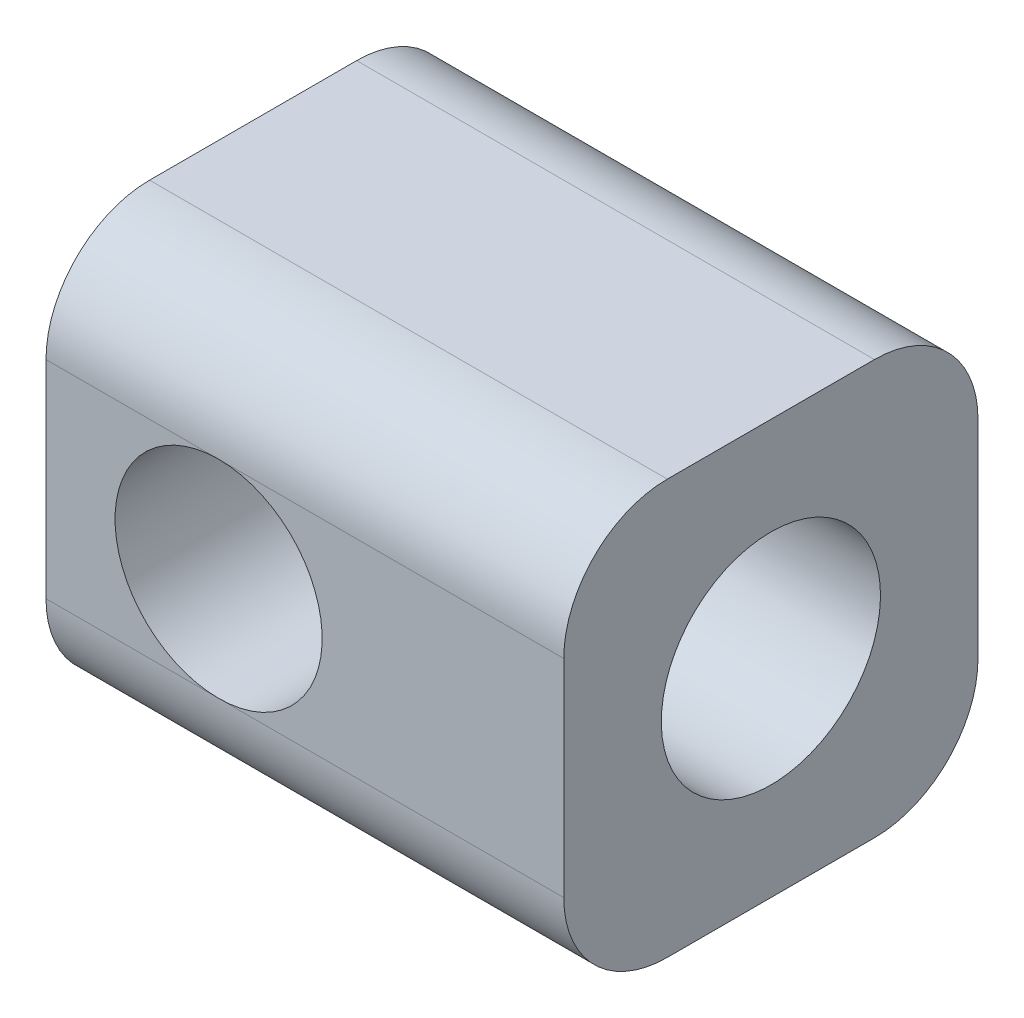
ISO-10303-21;
HEADER;
FILE_DESCRIPTION(('STEP AP214'),'2;1');
FILE_NAME('part.step','',(''),(''),'','','');
FILE_SCHEMA(('AUTOMOTIVE_DESIGN { 1 0 10303 214 1 1 1 1 }'));
ENDSEC;
DATA;
#1=APPLICATION_CONTEXT('core data for automotive mechanical design processes');
#2=APPLICATION_PROTOCOL_DEFINITION('international standard','automotive_design',2000,#1);
#3=PRODUCT_CONTEXT('',#1,'mechanical');
#4=PRODUCT('Part','Part','',(#3));
#5=PRODUCT_RELATED_PRODUCT_CATEGORY('part','',(#4));
#6=PRODUCT_DEFINITION_FORMATION('','',#4);
#7=PRODUCT_DEFINITION_CONTEXT('part definition',#1,'design');
#8=PRODUCT_DEFINITION('design','',#6,#7);
#9=PRODUCT_DEFINITION_SHAPE('','',#8);
#10=(LENGTH_UNIT() NAMED_UNIT(*) SI_UNIT(.MILLI.,.METRE.));
#11=(NAMED_UNIT(*) PLANE_ANGLE_UNIT() SI_UNIT($,.RADIAN.));
#12=(NAMED_UNIT(*) SI_UNIT($,.STERADIAN.) SOLID_ANGLE_UNIT());
#13=UNCERTAINTY_MEASURE_WITH_UNIT(LENGTH_MEASURE(1.E-05),#10,'distance_accuracy_value','');
#14=(GEOMETRIC_REPRESENTATION_CONTEXT(3) GLOBAL_UNCERTAINTY_ASSIGNED_CONTEXT((#13)) GLOBAL_UNIT_ASSIGNED_CONTEXT((#10,
#11,#12)) REPRESENTATION_CONTEXT('',''));
#15=CARTESIAN_POINT('',(0.,0.,0.));
#16=DIRECTION('',(0.,0.,1.));
#17=DIRECTION('',(1.,0.,0.));
#18=AXIS2_PLACEMENT_3D('',#15,#16,#17);
#19=CARTESIAN_POINT('',(0.,0.,12.));
#20=DIRECTION('',(0.,0.,-1.));
#21=DIRECTION('',(-1.,0.,0.));
#22=AXIS2_PLACEMENT_3D('',#19,#20,#21);
#23=PLANE('',#22);
#24=DIRECTION('',(0.,-1.,0.));
#25=VECTOR('',#24,1.);
#26=CARTESIAN_POINT('',(-5.,6.,12.));
#27=LINE('',#26,#25);
#28=CARTESIAN_POINT('',(-5.,3.,12.));
#29=VERTEX_POINT('',#28);
#30=CARTESIAN_POINT('',(-5.,-3.,12.));
#31=VERTEX_POINT('',#30);
#32=EDGE_CURVE('E216',#29,#31,#27,.T.);
#33=ORIENTED_EDGE('',*,*,#32,.T.);
#34=DIRECTION('',(1.,0.,0.));
#35=VECTOR('',#34,1.);
#36=CARTESIAN_POINT('',(0.,-3.,12.));
#37=LINE('',#36,#35);
#38=CARTESIAN_POINT('',(0.,-3.,12.));
#39=VERTEX_POINT('',#38);
#40=EDGE_CURVE('E275',#31,#39,#37,.T.);
#41=ORIENTED_EDGE('',*,*,#40,.T.);
#42=CARTESIAN_POINT('',(0.,0.,12.));
#43=DIRECTION('',(0.,0.,1.));
#44=DIRECTION('',(1.,0.,0.));
#45=AXIS2_PLACEMENT_3D('',#42,#43,#44);
#46=CIRCLE('',#45,3.);
#47=CARTESIAN_POINT('',(0.,3.,12.));
#48=VERTEX_POINT('',#47);
#49=EDGE_CURVE('E203',#48,#39,#46,.T.);
#50=ORIENTED_EDGE('',*,*,#49,.F.);
#51=DIRECTION('',(-1.,0.,0.));
#52=VECTOR('',#51,1.);
#53=CARTESIAN_POINT('',(0.,3.,12.));
#54=LINE('',#53,#52);
#55=EDGE_CURVE('E56',#48,#29,#54,.T.);
#56=ORIENTED_EDGE('',*,*,#55,.T.);
#57=EDGE_LOOP('',(#33,#41,#50,#56));
#58=FACE_BOUND('',#57,.T.);
#59=ADVANCED_FACE('F33',(#58),#23,.F.);
#60=CARTESIAN_POINT('',(0.,0.,0.));
#61=DIRECTION('',(0.,0.,-1.));
#62=DIRECTION('',(-1.,0.,0.));
#63=AXIS2_PLACEMENT_3D('',#60,#61,#62);
#64=PLANE('',#63);
#65=DIRECTION('',(0.,1.,0.));
#66=VECTOR('',#65,1.);
#67=CARTESIAN_POINT('',(10.,6.,0.));
#68=LINE('',#67,#66);
#69=CARTESIAN_POINT('',(10.,-3.,0.));
#70=VERTEX_POINT('',#69);
#71=CARTESIAN_POINT('',(10.,3.,0.));
#72=VERTEX_POINT('',#71);
#73=EDGE_CURVE('E209',#70,#72,#68,.T.);
#74=ORIENTED_EDGE('',*,*,#73,.F.);
#75=DIRECTION('',(1.,0.,0.));
#76=VECTOR('',#75,1.);
#77=CARTESIAN_POINT('',(-5.,-3.,0.));
#78=LINE('',#77,#76);
#79=CARTESIAN_POINT('',(0.,-3.,0.));
#80=VERTEX_POINT('',#79);
#81=EDGE_CURVE('E263',#70,#80,#78,.F.);
#82=ORIENTED_EDGE('',*,*,#81,.T.);
#83=CARTESIAN_POINT('',(0.,0.,0.));
#84=DIRECTION('',(0.,0.,1.));
#85=DIRECTION('',(1.,0.,0.));
#86=AXIS2_PLACEMENT_3D('',#83,#84,#85);
#87=CIRCLE('',#86,3.);
#88=CARTESIAN_POINT('',(0.,3.,0.));
#89=VERTEX_POINT('',#88);
#90=EDGE_CURVE('E140',#80,#89,#87,.T.);
#91=ORIENTED_EDGE('',*,*,#90,.T.);
#92=DIRECTION('',(-1.,0.,0.));
#93=VECTOR('',#92,1.);
#94=CARTESIAN_POINT('',(10.,3.,0.));
#95=LINE('',#94,#93);
#96=EDGE_CURVE('E257',#89,#72,#95,.F.);
#97=ORIENTED_EDGE('',*,*,#96,.T.);
#98=EDGE_LOOP('',(#74,#82,#91,#97));
#99=FACE_BOUND('',#98,.T.);
#100=ADVANCED_FACE('F176',(#99),#64,.T.);
#101=CARTESIAN_POINT('',(0.,0.,12.));
#102=DIRECTION('',(0.,0.,-1.));
#103=DIRECTION('',(-1.,0.,0.));
#104=AXIS2_PLACEMENT_3D('',#101,#102,#103);
#105=CYLINDRICAL_SURFACE('',#104,3.);
#106=ORIENTED_EDGE('',*,*,#49,.T.);
#107=EDGE_CURVE('E197',#39,#48,#46,.T.);
#108=ORIENTED_EDGE('',*,*,#107,.T.);
#109=EDGE_LOOP('',(#106,#108));
#110=FACE_BOUND('',#109,.T.);
#111=EDGE_CURVE('E204',#89,#80,#87,.T.);
#112=ORIENTED_EDGE('',*,*,#111,.F.);
#113=ORIENTED_EDGE('',*,*,#90,.F.);
#114=EDGE_LOOP('',(#112,#113));
#115=FACE_BOUND('',#114,.T.);
#116=CARTESIAN_POINT('',(0.,-3.,7.03953114431459));
#117=CARTESIAN_POINT('',(0.0386237414145725,-3.00000902596069,7.03947907339333));
#118=CARTESIAN_POINT('',(0.077191741271471,-2.99925418392717,7.0416840085267));
#119=CARTESIAN_POINT('',(0.153670356620564,-2.99630274009657,7.05015658215252));
#120=CARTESIAN_POINT('',(0.191583015848006,-2.99411204858188,7.05640756488609));
#121=CARTESIAN_POINT('',(0.302325512784669,-2.98563259746018,7.08022760956141));
#122=CARTESIAN_POINT('',(0.373911746826772,-2.9774281765451,7.10290418160596));
#123=CARTESIAN_POINT('',(0.498360581096125,-2.95884481821173,7.15169126914045));
#124=CARTESIAN_POINT('',(0.552050957062252,-2.94925757080144,7.17614226083754));
#125=CARTESIAN_POINT('',(0.657008734379159,-2.92766123490288,7.22892018324124));
#126=CARTESIAN_POINT('',(0.70827457212563,-2.91565060915546,7.25724957050499));
#127=CARTESIAN_POINT('',(0.860275392427387,-2.87594138502498,7.34678953024243));
#128=CARTESIAN_POINT('',(0.957780414907473,-2.84479327639407,7.41190592962394));
#129=CARTESIAN_POINT('',(1.14840861498714,-2.77338884677889,7.54757616252779));
#130=CARTESIAN_POINT('',(1.24140616390303,-2.73296378165888,7.61821235116885));
#131=CARTESIAN_POINT('',(1.42221803307757,-2.64338313136646,7.7607510815286));
#132=CARTESIAN_POINT('',(1.51002810982015,-2.59422052685146,7.83265459921106));
#133=CARTESIAN_POINT('',(1.68035120282555,-2.48726351914778,7.97536587954332));
#134=CARTESIAN_POINT('',(1.76288633872597,-2.42950907749845,8.04617712310709));
#135=CARTESIAN_POINT('',(1.92283380471833,-2.30498847076256,8.18549311032196));
#136=CARTESIAN_POINT('',(2.00024923633515,-2.23822783756438,8.25399923782706));
#137=CARTESIAN_POINT('',(2.18336641272797,-2.06288498919169,8.41771375606503));
#138=CARTESIAN_POINT('',(2.28595510917601,-1.94907552829243,8.51092605380873));
#139=CARTESIAN_POINT('',(2.47597716349436,-1.70113011021957,8.68508192561453));
#140=CARTESIAN_POINT('',(2.56342764033279,-1.56701743895335,8.76603934485019));
#141=CARTESIAN_POINT('',(2.70229077967412,-1.30932973919755,8.89525490761508));
#142=CARTESIAN_POINT('',(2.75741528278771,-1.18942221010328,8.94681060060623));
#143=CARTESIAN_POINT('',(2.85249227315262,-0.93870779714176,9.03596156538605));
#144=CARTESIAN_POINT('',(2.89245502874539,-0.807908363325609,9.07356628513166));
#145=CARTESIAN_POINT('',(2.9390981328215,-0.605461356604541,9.11751458141742));
#146=CARTESIAN_POINT('',(2.9524581070525,-0.536619520762502,9.13011520004243));
#147=CARTESIAN_POINT('',(2.97437781216004,-0.397519653742324,9.15079906570895));
#148=CARTESIAN_POINT('',(2.98293987330491,-0.327262327251928,9.15888450569265));
#149=CARTESIAN_POINT('',(2.99507086233577,-0.185950737316526,9.17034233146573));
#150=CARTESIAN_POINT('',(2.99864102354096,-0.114896675090901,9.17371588139371));
#151=CARTESIAN_POINT('',(3.00071992156506,0.0273281394377825,9.17568029065169));
#152=CARTESIAN_POINT('',(2.99922918770584,0.0984988787593104,9.17427165015369));
#153=CARTESIAN_POINT('',(2.98816022983791,0.293930701974193,9.16381392438657));
#154=CARTESIAN_POINT('',(2.9733247453996,0.417696940171533,9.14979835587381));
#155=CARTESIAN_POINT('',(2.92907854121659,0.660094995851278,9.10806586117788));
#156=CARTESIAN_POINT('',(2.89966548966234,0.778725988604086,9.08034674299368));
#157=CARTESIAN_POINT('',(2.82705648635023,1.01143192503278,9.01209484117222));
#158=CARTESIAN_POINT('',(2.78351897112101,1.12530550201754,8.97124477139125));
#159=CARTESIAN_POINT('',(2.68504873203715,1.34345274972221,8.87920245240652));
#160=CARTESIAN_POINT('',(2.63011185130384,1.44772289838461,8.82800643063878));
#161=CARTESIAN_POINT('',(2.4799558295988,1.69723851572361,8.68879977035802));
#162=CARTESIAN_POINT('',(2.3785916736286,1.8358105479557,8.59543707337147));
#163=CARTESIAN_POINT('',(2.15942529990749,2.08928852819717,8.39616565001319));
#164=CARTESIAN_POINT('',(2.04157222492708,2.20411842395232,8.29021826713069));
#165=CARTESIAN_POINT('',(1.83846923363854,2.37286810045156,8.11168231401367));
#166=CARTESIAN_POINT('',(1.75707591257527,2.43369787012433,8.04107853816913));
#167=CARTESIAN_POINT('',(1.58927348273243,2.54645732332912,7.89853492520537));
#168=CARTESIAN_POINT('',(1.50286037720401,2.59837978116328,7.82659405536106));
#169=CARTESIAN_POINT('',(1.32494777339686,2.69345364991622,7.68324909468567));
#170=CARTESIAN_POINT('',(1.23344870165354,2.73660579494964,7.6118449594097));
#171=CARTESIAN_POINT('',(1.04455892460352,2.81413120001225,7.47227873616029));
#172=CARTESIAN_POINT('',(0.947177041593537,2.84851722101503,7.40411205445834));
#173=CARTESIAN_POINT('',(0.775323429950739,2.89900814824822,7.29568443169882));
#174=CARTESIAN_POINT('',(0.702938065203922,2.917488921965,7.25325907625086));
#175=CARTESIAN_POINT('',(0.55377856022368,2.94942369765177,7.17611054301172));
#176=CARTESIAN_POINT('',(0.477049642143094,2.96292132808154,7.14132165287264));
#177=CARTESIAN_POINT('',(0.33467823517974,2.98194188885186,7.09052313661807));
#178=CARTESIAN_POINT('',(0.270094610384132,2.98854461672715,7.07210341179885));
#179=CARTESIAN_POINT('',(0.170725118252341,2.99532719168375,7.05294251041164));
#180=CARTESIAN_POINT('',(0.136858598708708,2.99706891472262,7.04796157680255));
#181=CARTESIAN_POINT('',(0.0686729674424466,2.99940978786202,7.04123518857114));
#182=CARTESIAN_POINT('',(0.0343528398070632,3.00000566256942,7.03949900943543));
#183=CARTESIAN_POINT('',(-1.51464542244097E-13,3.00000000000003,7.03953114431503));
#184=B_SPLINE_CURVE_WITH_KNOTS('',3,(#116,#117,#118,#119,#120,#121,#122,#123,#124,#125,#126,
#127,#128,#129,#130,#131,#132,#133,#134,#135,#136,#137,#138,#139,#140,#141,#142,#143,#144,#145,
#146,#147,#148,#149,#150,#151,#152,#153,#154,#155,#156,#157,#158,#159,#160,#161,#162,#163,#164,
#165,#166,#167,#168,#169,#170,#171,#172,#173,#174,#175,#176,#177,#178,#179,#180,#181,#182,#183),
.UNSPECIFIED.,.F.,.F.,(4,2,2,2,2,2,2,2,2,2,2,2,2,2,2,2,2,2,2,2,2,2,2,2,2,2,2,2,2,2,2,2,2,4),(0.,
0.115707852134544,0.230942390599249,0.456263444007898,0.635347993460676,0.814546503579332,
1.17766371562131,1.54799891599954,1.91863298285451,2.28759417687732,2.65632976643466,
3.19245792984402,3.72797579797249,4.15143300008061,4.57460290033464,4.78808266091405,
5.00145864778265,5.21478190778768,5.42808285687984,5.80246114248235,6.17689933250815,
6.56116743588479,6.94557591303456,7.52865116230385,8.11356616626125,8.48437803210382,
8.85548929613308,9.22656948367514,9.59710635948357,9.85447723484143,10.1095381067564,
10.3109967764483,10.4136582371093,10.5166127205756),.UNSPECIFIED.);
#185=CARTESIAN_POINT('',(0.,-3.,7.03953114431459));
#186=VERTEX_POINT('',#185);
#187=CARTESIAN_POINT('',(0.,3.,7.03953114431459));
#188=VERTEX_POINT('',#187);
#189=EDGE_CURVE('E131',#186,#188,#184,.T.);
#190=ORIENTED_EDGE('',*,*,#189,.F.);
#191=DIRECTION('',(0.,0.,-1.));
#192=VECTOR('',#191,1.);
#193=CARTESIAN_POINT('',(0.,-3.,12.));
#194=LINE('',#193,#192);
#195=CARTESIAN_POINT('',(0.,-3.,4.96046885568541));
#196=VERTEX_POINT('',#195);
#197=EDGE_CURVE('E123',#186,#196,#194,.T.);
#198=ORIENTED_EDGE('',*,*,#197,.T.);
#199=CARTESIAN_POINT('',(0.,3.,4.96046885568541));
#200=CARTESIAN_POINT('',(0.0386237414145718,3.00000902596069,4.96052092660667));
#201=CARTESIAN_POINT('',(0.0771917412714701,2.99925418392717,4.9583159914733));
#202=CARTESIAN_POINT('',(0.153670356620563,2.99630274009657,4.94984341784748));
#203=CARTESIAN_POINT('',(0.191583015848005,2.99411204858188,4.94359243511391));
#204=CARTESIAN_POINT('',(0.302325512784668,2.98563259746018,4.91977239043859));
#205=CARTESIAN_POINT('',(0.373911746826771,2.9774281765451,4.89709581839404));
#206=CARTESIAN_POINT('',(0.498360581096125,2.95884481821173,4.84830873085955));
#207=CARTESIAN_POINT('',(0.552050957062251,2.94925757080144,4.82385773916246));
#208=CARTESIAN_POINT('',(0.657008734379159,2.92766123490288,4.77107981675876));
#209=CARTESIAN_POINT('',(0.70827457212563,2.91565060915546,4.74275042949501));
#210=CARTESIAN_POINT('',(0.860275392427387,2.87594138502498,4.65321046975757));
#211=CARTESIAN_POINT('',(0.957780414907473,2.84479327639407,4.58809407037606));
#212=CARTESIAN_POINT('',(1.14840861498714,2.77338884677889,4.45242383747221));
#213=CARTESIAN_POINT('',(1.24140616390303,2.73296378165888,4.38178764883115));
#214=CARTESIAN_POINT('',(1.42221803307757,2.64338313136646,4.2392489184714));
#215=CARTESIAN_POINT('',(1.51002810982015,2.59422052685146,4.16734540078894));
#216=CARTESIAN_POINT('',(1.68035120282556,2.48726351914778,4.02463412045668));
#217=CARTESIAN_POINT('',(1.76288633872597,2.42950907749845,3.95382287689291));
#218=CARTESIAN_POINT('',(1.92283380471833,2.30498847076256,3.81450688967804));
#219=CARTESIAN_POINT('',(2.00024923633516,2.23822783756437,3.74600076217293));
#220=CARTESIAN_POINT('',(2.18336641272798,2.06288498919169,3.58228624393497));
#221=CARTESIAN_POINT('',(2.28595510917601,1.94907552829243,3.48907394619127));
#222=CARTESIAN_POINT('',(2.47597716349436,1.70113011021957,3.31491807438547));
#223=CARTESIAN_POINT('',(2.56342764033279,1.56701743895335,3.23396065514981));
#224=CARTESIAN_POINT('',(2.70229077967412,1.30932973919755,3.10474509238492));
#225=CARTESIAN_POINT('',(2.75741528278771,1.18942221010328,3.05318939939377));
#226=CARTESIAN_POINT('',(2.85249227315262,0.93870779714176,2.96403843461395));
#227=CARTESIAN_POINT('',(2.89245502874539,0.807908363325609,2.92643371486834));
#228=CARTESIAN_POINT('',(2.9390981328215,0.605461356604541,2.88248541858258));
#229=CARTESIAN_POINT('',(2.9524581070525,0.536619520762502,2.86988479995757));
#230=CARTESIAN_POINT('',(2.97437781216004,0.397519653742324,2.84920093429105));
#231=CARTESIAN_POINT('',(2.98293987330491,0.327262327251929,2.84111549430735));
#232=CARTESIAN_POINT('',(2.99507086233577,0.185950737316527,2.82965766853427));
#233=CARTESIAN_POINT('',(2.99864102354096,0.114896675090902,2.82628411860629));
#234=CARTESIAN_POINT('',(3.00071992156506,-0.0273281394377821,2.82431970934831));
#235=CARTESIAN_POINT('',(2.99922918770584,-0.0984988787593103,2.82572834984631));
#236=CARTESIAN_POINT('',(2.98816022983791,-0.293930701974194,2.83618607561343));
#237=CARTESIAN_POINT('',(2.9733247453996,-0.417696940171534,2.85020164412619));
#238=CARTESIAN_POINT('',(2.92907854121659,-0.660094995851278,2.89193413882212));
#239=CARTESIAN_POINT('',(2.89966548966234,-0.778725988604087,2.91965325700632));
#240=CARTESIAN_POINT('',(2.82705648635023,-1.01143192503278,2.98790515882778));
#241=CARTESIAN_POINT('',(2.78351897112101,-1.12530550201754,3.02875522860875));
#242=CARTESIAN_POINT('',(2.68504873203714,-1.34345274972221,3.12079754759348));
#243=CARTESIAN_POINT('',(2.63011185130384,-1.44772289838461,3.17199356936122));
#244=CARTESIAN_POINT('',(2.4799558295988,-1.69723851572361,3.31120022964198));
#245=CARTESIAN_POINT('',(2.3785916736286,-1.8358105479557,3.40456292662853));
#246=CARTESIAN_POINT('',(2.15942529990749,-2.08928852819717,3.60383434998681));
#247=CARTESIAN_POINT('',(2.04157222492708,-2.20411842395232,3.70978173286931));
#248=CARTESIAN_POINT('',(1.83846923363854,-2.37286810045156,3.88831768598633));
#249=CARTESIAN_POINT('',(1.75707591257527,-2.43369787012433,3.95892146183087));
#250=CARTESIAN_POINT('',(1.58927348273243,-2.54645732332913,4.10146507479463));
#251=CARTESIAN_POINT('',(1.50286037720401,-2.59837978116328,4.17340594463894));
#252=CARTESIAN_POINT('',(1.32494777339686,-2.69345364991622,4.31675090531434));
#253=CARTESIAN_POINT('',(1.23344870165354,-2.73660579494964,4.3881550405903));
#254=CARTESIAN_POINT('',(1.04455892460352,-2.81413120001225,4.52772126383971));
#255=CARTESIAN_POINT('',(0.947177041593535,-2.84851722101503,4.59588794554166));
#256=CARTESIAN_POINT('',(0.775323429950737,-2.89900814824822,4.70431556830118));
#257=CARTESIAN_POINT('',(0.70293806520392,-2.91748892196501,4.74674092374915));
#258=CARTESIAN_POINT('',(0.553778560223678,-2.94942369765177,4.82388945698828));
#259=CARTESIAN_POINT('',(0.477049642143092,-2.96292132808154,4.85867834712736));
#260=CARTESIAN_POINT('',(0.334678235179739,-2.98194188885186,4.90947686338193));
#261=CARTESIAN_POINT('',(0.270094610384131,-2.98854461672715,4.92789658820115));
#262=CARTESIAN_POINT('',(0.17072511825234,-2.99532719168375,4.94705748958836));
#263=CARTESIAN_POINT('',(0.136858598708708,-2.99706891472262,4.95203842319745));
#264=CARTESIAN_POINT('',(0.0686729674424471,-2.99940978786202,4.95876481142886));
#265=CARTESIAN_POINT('',(0.0343528398070638,-3.00000566256942,4.96050099056457));
#266=CARTESIAN_POINT('',(-1.50790094327798E-13,-3.00000000000003,4.96046885568497));
#267=B_SPLINE_CURVE_WITH_KNOTS('',3,(#199,#200,#201,#202,#203,#204,#205,#206,#207,#208,#209,
#210,#211,#212,#213,#214,#215,#216,#217,#218,#219,#220,#221,#222,#223,#224,#225,#226,#227,#228,
#229,#230,#231,#232,#233,#234,#235,#236,#237,#238,#239,#240,#241,#242,#243,#244,#245,#246,#247,
#248,#249,#250,#251,#252,#253,#254,#255,#256,#257,#258,#259,#260,#261,#262,#263,#264,#265,#266),
.UNSPECIFIED.,.F.,.F.,(4,2,2,2,2,2,2,2,2,2,2,2,2,2,2,2,2,2,2,2,2,2,2,2,2,2,2,2,2,2,2,2,2,4),(0.,
0.115707852134544,0.230942390599249,0.456263444007898,0.635347993460676,0.814546503579332,
1.17766371562131,1.54799891599955,1.91863298285451,2.28759417687733,2.65632976643466,
3.19245792984403,3.72797579797249,4.15143300008061,4.57460290033464,4.78808266091405,
5.00145864778265,5.21478190778768,5.42808285687984,5.80246114248235,6.17689933250815,
6.56116743588479,6.94557591303456,7.52865116230386,8.11356616626125,8.48437803210382,
8.85548929613308,9.22656948367514,9.59710635948357,9.85447723484143,10.1095381067564,
10.3109967764483,10.4136582371093,10.5166127205756),.UNSPECIFIED.);
#268=CARTESIAN_POINT('',(0.,3.,4.96046885568541));
#269=VERTEX_POINT('',#268);
#270=EDGE_CURVE('E139',#269,#196,#267,.T.);
#271=ORIENTED_EDGE('',*,*,#270,.F.);
#272=DIRECTION('',(0.,0.,-1.));
#273=VECTOR('',#272,1.);
#274=CARTESIAN_POINT('',(0.,3.,12.));
#275=LINE('',#274,#273);
#276=EDGE_CURVE('E144',#269,#188,#275,.F.);
#277=ORIENTED_EDGE('',*,*,#276,.T.);
#278=EDGE_LOOP('',(#190,#198,#271,#277));
#279=FACE_BOUND('',#278,.T.);
#280=ADVANCED_FACE('F143',(#110,#115,#279),#105,.F.);
#281=ORIENTED_EDGE('',*,*,#107,.F.);
#282=DIRECTION('',(1.,0.,0.));
#283=VECTOR('',#282,1.);
#284=CARTESIAN_POINT('',(0.,-3.,12.));
#285=LINE('',#284,#283);
#286=CARTESIAN_POINT('',(10.,-3.,12.));
#287=VERTEX_POINT('',#286);
#288=EDGE_CURVE('E48',#39,#287,#285,.T.);
#289=ORIENTED_EDGE('',*,*,#288,.T.);
#290=DIRECTION('',(0.,1.,0.));
#291=VECTOR('',#290,1.);
#292=CARTESIAN_POINT('',(10.,6.,12.));
#293=LINE('',#292,#291);
#294=CARTESIAN_POINT('',(10.,3.,12.));
#295=VERTEX_POINT('',#294);
#296=EDGE_CURVE('E218',#287,#295,#293,.T.);
#297=ORIENTED_EDGE('',*,*,#296,.T.);
#298=DIRECTION('',(-1.,0.,0.));
#299=VECTOR('',#298,1.);
#300=CARTESIAN_POINT('',(0.,3.,12.));
#301=LINE('',#300,#299);
#302=EDGE_CURVE('E201',#295,#48,#301,.T.);
#303=ORIENTED_EDGE('',*,*,#302,.T.);
#304=EDGE_LOOP('',(#281,#289,#297,#303));
#305=FACE_BOUND('',#304,.T.);
#306=ADVANCED_FACE('F178',(#305),#23,.F.);
#307=ORIENTED_EDGE('',*,*,#111,.T.);
#308=DIRECTION('',(1.,0.,0.));
#309=VECTOR('',#308,1.);
#310=CARTESIAN_POINT('',(-5.,-3.,0.));
#311=LINE('',#310,#309);
#312=CARTESIAN_POINT('',(-5.,-3.,0.));
#313=VERTEX_POINT('',#312);
#314=EDGE_CURVE('E261',#80,#313,#311,.F.);
#315=ORIENTED_EDGE('',*,*,#314,.T.);
#316=DIRECTION('',(0.,-1.,0.));
#317=VECTOR('',#316,1.);
#318=CARTESIAN_POINT('',(-5.,6.,0.));
#319=LINE('',#318,#317);
#320=CARTESIAN_POINT('',(-5.,3.,0.));
#321=VERTEX_POINT('',#320);
#322=EDGE_CURVE('E207',#321,#313,#319,.T.);
#323=ORIENTED_EDGE('',*,*,#322,.F.);
#324=DIRECTION('',(-1.,0.,0.));
#325=VECTOR('',#324,1.);
#326=CARTESIAN_POINT('',(10.,3.,0.));
#327=LINE('',#326,#325);
#328=EDGE_CURVE('E259',#321,#89,#327,.F.);
#329=ORIENTED_EDGE('',*,*,#328,.T.);
#330=EDGE_LOOP('',(#307,#315,#323,#329));
#331=FACE_BOUND('',#330,.T.);
#332=ADVANCED_FACE('F184',(#331),#64,.T.);
#333=CARTESIAN_POINT('',(-5.,6.,12.));
#334=DIRECTION('',(1.,0.,0.));
#335=DIRECTION('',(0.,1.,0.));
#336=AXIS2_PLACEMENT_3D('',#333,#334,#335);
#337=PLANE('',#336);
#338=ORIENTED_EDGE('',*,*,#322,.T.);
#339=CARTESIAN_POINT('',(-5.,-3.,3.));
#340=DIRECTION('',(1.,0.,0.));
#341=DIRECTION('',(0.,1.,0.));
#342=AXIS2_PLACEMENT_3D('',#339,#340,#341);
#343=CIRCLE('',#342,3.);
#344=CARTESIAN_POINT('',(-5.,-6.,3.));
#345=VERTEX_POINT('',#344);
#346=EDGE_CURVE('E245',#313,#345,#343,.F.);
#347=ORIENTED_EDGE('',*,*,#346,.T.);
#348=DIRECTION('',(0.,0.,-1.));
#349=VECTOR('',#348,1.);
#350=CARTESIAN_POINT('',(-5.,-6.,12.));
#351=LINE('',#350,#349);
#352=CARTESIAN_POINT('',(-5.,-6.,9.));
#353=VERTEX_POINT('',#352);
#354=EDGE_CURVE('E231',#353,#345,#351,.T.);
#355=ORIENTED_EDGE('',*,*,#354,.F.);
#356=CARTESIAN_POINT('',(-5.,-3.,9.));
#357=DIRECTION('',(1.,0.,0.));
#358=DIRECTION('',(0.,1.,0.));
#359=AXIS2_PLACEMENT_3D('',#356,#357,#358);
#360=CIRCLE('',#359,3.);
#361=EDGE_CURVE('E269',#353,#31,#360,.F.);
#362=ORIENTED_EDGE('',*,*,#361,.T.);
#363=ORIENTED_EDGE('',*,*,#32,.F.);
#364=CARTESIAN_POINT('',(-5.,3.,9.));
#365=DIRECTION('',(1.,0.,0.));
#366=DIRECTION('',(0.,1.,0.));
#367=AXIS2_PLACEMENT_3D('',#364,#365,#366);
#368=CIRCLE('',#367,3.);
#369=CARTESIAN_POINT('',(-5.,6.,9.));
#370=VERTEX_POINT('',#369);
#371=EDGE_CURVE('E267',#29,#370,#368,.F.);
#372=ORIENTED_EDGE('',*,*,#371,.T.);
#373=DIRECTION('',(0.,0.,-1.));
#374=VECTOR('',#373,1.);
#375=CARTESIAN_POINT('',(-5.,6.,12.));
#376=LINE('',#375,#374);
#377=CARTESIAN_POINT('',(-5.,6.,3.));
#378=VERTEX_POINT('',#377);
#379=EDGE_CURVE('E219',#370,#378,#376,.T.);
#380=ORIENTED_EDGE('',*,*,#379,.T.);
#381=CARTESIAN_POINT('',(-5.,3.,3.));
#382=DIRECTION('',(1.,0.,0.));
#383=DIRECTION('',(0.,1.,0.));
#384=AXIS2_PLACEMENT_3D('',#381,#382,#383);
#385=CIRCLE('',#384,3.);
#386=EDGE_CURVE('E265',#378,#321,#385,.F.);
#387=ORIENTED_EDGE('',*,*,#386,.T.);
#388=EDGE_LOOP('',(#338,#347,#355,#362,#363,#372,#380,#387));
#389=FACE_BOUND('',#388,.T.);
#390=ADVANCED_FACE('F192',(#389),#337,.F.);
#391=CARTESIAN_POINT('',(10.,-6.,12.));
#392=DIRECTION('',(0.,1.,0.));
#393=DIRECTION('',(-1.,0.,0.));
#394=AXIS2_PLACEMENT_3D('',#391,#392,#393);
#395=PLANE('',#394);
#396=ORIENTED_EDGE('',*,*,#354,.T.);
#397=DIRECTION('',(1.,0.,0.));
#398=VECTOR('',#397,1.);
#399=CARTESIAN_POINT('',(10.,-6.,3.));
#400=LINE('',#399,#398);
#401=CARTESIAN_POINT('',(10.,-6.,3.));
#402=VERTEX_POINT('',#401);
#403=EDGE_CURVE('E239',#345,#402,#400,.T.);
#404=ORIENTED_EDGE('',*,*,#403,.T.);
#405=DIRECTION('',(0.,0.,-1.));
#406=VECTOR('',#405,1.);
#407=CARTESIAN_POINT('',(10.,-6.,12.));
#408=LINE('',#407,#406);
#409=CARTESIAN_POINT('',(10.,-6.,9.));
#410=VERTEX_POINT('',#409);
#411=EDGE_CURVE('E228',#410,#402,#408,.T.);
#412=ORIENTED_EDGE('',*,*,#411,.F.);
#413=DIRECTION('',(1.,0.,0.));
#414=VECTOR('',#413,1.);
#415=CARTESIAN_POINT('',(10.,-6.,9.));
#416=LINE('',#415,#414);
#417=EDGE_CURVE('E130',#410,#353,#416,.F.);
#418=ORIENTED_EDGE('',*,*,#417,.T.);
#419=EDGE_LOOP('',(#396,#404,#412,#418));
#420=FACE_BOUND('',#419,.T.);
#421=ADVANCED_FACE('F237',(#420),#395,.F.);
#422=CARTESIAN_POINT('',(10.,6.,12.));
#423=DIRECTION('',(-1.,0.,0.));
#424=DIRECTION('',(0.,-1.,0.));
#425=AXIS2_PLACEMENT_3D('',#422,#423,#424);
#426=PLANE('',#425);
#427=CARTESIAN_POINT('',(10.,0.,6.));
#428=DIRECTION('',(1.,0.,0.));
#429=DIRECTION('',(0.,1.,0.));
#430=AXIS2_PLACEMENT_3D('',#427,#428,#429);
#431=CIRCLE('',#430,3.175);
#432=CARTESIAN_POINT('',(10.,3.175,6.));
#433=VERTEX_POINT('',#432);
#434=EDGE_CURVE('E213',#433,#433,#431,.T.);
#435=ORIENTED_EDGE('',*,*,#434,.F.);
#436=EDGE_LOOP('',(#435));
#437=FACE_BOUND('',#436,.T.);
#438=ORIENTED_EDGE('',*,*,#411,.T.);
#439=CARTESIAN_POINT('',(10.,-3.,3.));
#440=DIRECTION('',(-1.,0.,0.));
#441=DIRECTION('',(0.,-1.,0.));
#442=AXIS2_PLACEMENT_3D('',#439,#440,#441);
#443=CIRCLE('',#442,3.);
#444=EDGE_CURVE('E247',#402,#70,#443,.F.);
#445=ORIENTED_EDGE('',*,*,#444,.T.);
#446=ORIENTED_EDGE('',*,*,#73,.T.);
#447=CARTESIAN_POINT('',(10.,3.,3.));
#448=DIRECTION('',(-1.,0.,0.));
#449=DIRECTION('',(0.,-1.,0.));
#450=AXIS2_PLACEMENT_3D('',#447,#448,#449);
#451=CIRCLE('',#450,3.);
#452=CARTESIAN_POINT('',(10.,6.,3.));
#453=VERTEX_POINT('',#452);
#454=EDGE_CURVE('E248',#72,#453,#451,.F.);
#455=ORIENTED_EDGE('',*,*,#454,.T.);
#456=DIRECTION('',(0.,0.,-1.));
#457=VECTOR('',#456,1.);
#458=CARTESIAN_POINT('',(10.,6.,12.));
#459=LINE('',#458,#457);
#460=CARTESIAN_POINT('',(10.,6.,9.));
#461=VERTEX_POINT('',#460);
#462=EDGE_CURVE('E225',#461,#453,#459,.T.);
#463=ORIENTED_EDGE('',*,*,#462,.F.);
#464=CARTESIAN_POINT('',(10.,3.,9.));
#465=DIRECTION('',(-1.,0.,0.));
#466=DIRECTION('',(0.,-1.,0.));
#467=AXIS2_PLACEMENT_3D('',#464,#465,#466);
#468=CIRCLE('',#467,3.);
#469=EDGE_CURVE('E250',#461,#295,#468,.F.);
#470=ORIENTED_EDGE('',*,*,#469,.T.);
#471=ORIENTED_EDGE('',*,*,#296,.F.);
#472=CARTESIAN_POINT('',(10.,-3.,9.));
#473=DIRECTION('',(-1.,0.,0.));
#474=DIRECTION('',(0.,-1.,0.));
#475=AXIS2_PLACEMENT_3D('',#472,#473,#474);
#476=CIRCLE('',#475,3.);
#477=EDGE_CURVE('E254',#287,#410,#476,.F.);
#478=ORIENTED_EDGE('',*,*,#477,.T.);
#479=EDGE_LOOP('',(#438,#445,#446,#455,#463,#470,#471,#478));
#480=FACE_BOUND('',#479,.T.);
#481=ADVANCED_FACE('F289',(#437,#480),#426,.F.);
#482=CARTESIAN_POINT('',(10.,6.,12.));
#483=DIRECTION('',(0.,-1.,0.));
#484=DIRECTION('',(1.,0.,0.));
#485=AXIS2_PLACEMENT_3D('',#482,#483,#484);
#486=PLANE('',#485);
#487=ORIENTED_EDGE('',*,*,#379,.F.);
#488=DIRECTION('',(-1.,0.,0.));
#489=VECTOR('',#488,1.);
#490=CARTESIAN_POINT('',(10.,6.,9.));
#491=LINE('',#490,#489);
#492=EDGE_CURVE('E11',#370,#461,#491,.F.);
#493=ORIENTED_EDGE('',*,*,#492,.T.);
#494=ORIENTED_EDGE('',*,*,#462,.T.);
#495=DIRECTION('',(-1.,0.,0.));
#496=VECTOR('',#495,1.);
#497=CARTESIAN_POINT('',(-5.,6.,3.));
#498=LINE('',#497,#496);
#499=EDGE_CURVE('E41',#453,#378,#498,.T.);
#500=ORIENTED_EDGE('',*,*,#499,.T.);
#501=EDGE_LOOP('',(#487,#493,#494,#500));
#502=FACE_BOUND('',#501,.T.);
#503=ADVANCED_FACE('F174',(#502),#486,.F.);
#504=CARTESIAN_POINT('',(0.,0.,6.));
#505=DIRECTION('',(1.,0.,0.));
#506=DIRECTION('',(0.,1.,0.));
#507=AXIS2_PLACEMENT_3D('',#504,#505,#506);
#508=PLANE('',#507);
#509=CARTESIAN_POINT('',(0.,0.,6.));
#510=DIRECTION('',(1.,0.,0.));
#511=DIRECTION('',(0.,1.,0.));
#512=AXIS2_PLACEMENT_3D('',#509,#510,#511);
#513=CIRCLE('',#512,3.175);
#514=EDGE_CURVE('E126',#186,#196,#513,.T.);
#515=ORIENTED_EDGE('',*,*,#514,.T.);
#516=ORIENTED_EDGE('',*,*,#197,.F.);
#517=EDGE_LOOP('',(#515,#516));
#518=FACE_BOUND('',#517,.T.);
#519=ADVANCED_FACE('F125',(#518),#508,.T.);
#520=CARTESIAN_POINT('',(0.,0.,6.));
#521=DIRECTION('',(1.,0.,0.));
#522=DIRECTION('',(0.,1.,0.));
#523=AXIS2_PLACEMENT_3D('',#520,#521,#522);
#524=CYLINDRICAL_SURFACE('',#523,3.175);
#525=ORIENTED_EDGE('',*,*,#189,.T.);
#526=EDGE_CURVE('E141',#269,#188,#513,.T.);
#527=ORIENTED_EDGE('',*,*,#526,.F.);
#528=ORIENTED_EDGE('',*,*,#270,.T.);
#529=ORIENTED_EDGE('',*,*,#514,.F.);
#530=EDGE_LOOP('',(#525,#527,#528,#529));
#531=FACE_BOUND('',#530,.T.);
#532=ORIENTED_EDGE('',*,*,#434,.T.);
#533=EDGE_LOOP('',(#532));
#534=FACE_BOUND('',#533,.T.);
#535=ADVANCED_FACE('F135',(#531,#534),#524,.F.);
#536=ORIENTED_EDGE('',*,*,#526,.T.);
#537=ORIENTED_EDGE('',*,*,#276,.F.);
#538=EDGE_LOOP('',(#536,#537));
#539=FACE_BOUND('',#538,.T.);
#540=ADVANCED_FACE('F162',(#539),#508,.T.);
#541=CARTESIAN_POINT('',(10.,-3.,3.));
#542=DIRECTION('',(-1.,0.,0.));
#543=DIRECTION('',(0.,-1.,0.));
#544=AXIS2_PLACEMENT_3D('',#541,#542,#543);
#545=CYLINDRICAL_SURFACE('',#544,3.);
#546=ORIENTED_EDGE('',*,*,#314,.F.);
#547=ORIENTED_EDGE('',*,*,#81,.F.);
#548=ORIENTED_EDGE('',*,*,#444,.F.);
#549=ORIENTED_EDGE('',*,*,#403,.F.);
#550=ORIENTED_EDGE('',*,*,#346,.F.);
#551=EDGE_LOOP('',(#546,#547,#548,#549,#550));
#552=FACE_BOUND('',#551,.T.);
#553=ADVANCED_FACE('F165',(#552),#545,.T.);
#554=CARTESIAN_POINT('',(0.,-3.,9.));
#555=DIRECTION('',(1.,0.,0.));
#556=DIRECTION('',(0.,1.,0.));
#557=AXIS2_PLACEMENT_3D('',#554,#555,#556);
#558=CYLINDRICAL_SURFACE('',#557,3.);
#559=ORIENTED_EDGE('',*,*,#361,.F.);
#560=ORIENTED_EDGE('',*,*,#417,.F.);
#561=ORIENTED_EDGE('',*,*,#477,.F.);
#562=ORIENTED_EDGE('',*,*,#288,.F.);
#563=ORIENTED_EDGE('',*,*,#40,.F.);
#564=EDGE_LOOP('',(#559,#560,#561,#562,#563));
#565=FACE_BOUND('',#564,.T.);
#566=ADVANCED_FACE('F170',(#565),#558,.T.);
#567=CARTESIAN_POINT('',(0.,3.,9.));
#568=DIRECTION('',(-1.,0.,0.));
#569=DIRECTION('',(0.,-1.,0.));
#570=AXIS2_PLACEMENT_3D('',#567,#568,#569);
#571=CYLINDRICAL_SURFACE('',#570,3.);
#572=ORIENTED_EDGE('',*,*,#469,.F.);
#573=ORIENTED_EDGE('',*,*,#492,.F.);
#574=ORIENTED_EDGE('',*,*,#371,.F.);
#575=ORIENTED_EDGE('',*,*,#55,.F.);
#576=ORIENTED_EDGE('',*,*,#302,.F.);
#577=EDGE_LOOP('',(#572,#573,#574,#575,#576));
#578=FACE_BOUND('',#577,.T.);
#579=ADVANCED_FACE('F287',(#578),#571,.T.);
#580=CARTESIAN_POINT('',(10.,3.,3.));
#581=DIRECTION('',(1.,0.,0.));
#582=DIRECTION('',(0.,1.,0.));
#583=AXIS2_PLACEMENT_3D('',#580,#581,#582);
#584=CYLINDRICAL_SURFACE('',#583,3.);
#585=ORIENTED_EDGE('',*,*,#96,.F.);
#586=ORIENTED_EDGE('',*,*,#328,.F.);
#587=ORIENTED_EDGE('',*,*,#386,.F.);
#588=ORIENTED_EDGE('',*,*,#499,.F.);
#589=ORIENTED_EDGE('',*,*,#454,.F.);
#590=EDGE_LOOP('',(#585,#586,#587,#588,#589));
#591=FACE_BOUND('',#590,.T.);
#592=ADVANCED_FACE('F35',(#591),#584,.T.);
#593=CLOSED_SHELL('',(#59,#100,#280,#306,#332,#390,#421,#481,#503,#519,#535,#540,#553,#566,#579,#592));
#594=MANIFOLD_SOLID_BREP('B2',#593);
#595=ADVANCED_BREP_SHAPE_REPRESENTATION('',(#18,#594),#14);
#596=SHAPE_DEFINITION_REPRESENTATION(#9,#595);
ENDSEC;
END-ISO-10303-21;
